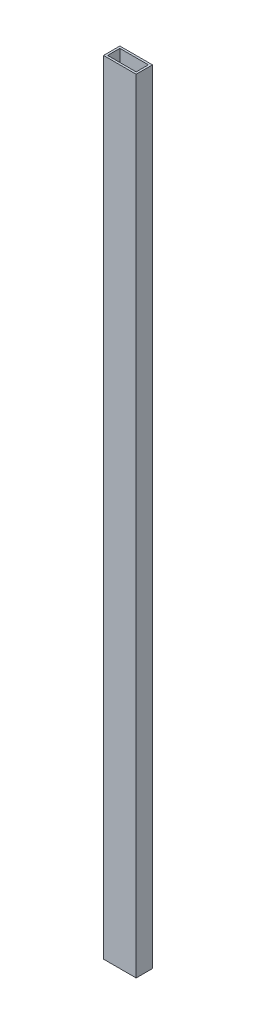
ISO-10303-21;
HEADER;
FILE_DESCRIPTION(('STEP AP214'),'2;1');
FILE_NAME('part.step','',(''),(''),'','','');
FILE_SCHEMA(('AUTOMOTIVE_DESIGN { 1 0 10303 214 1 1 1 1 }'));
ENDSEC;
DATA;
#1=APPLICATION_CONTEXT('core data for automotive mechanical design processes');
#2=APPLICATION_PROTOCOL_DEFINITION('international standard','automotive_design',2000,#1);
#3=PRODUCT_CONTEXT('',#1,'mechanical');
#4=PRODUCT('Part','Part','',(#3));
#5=PRODUCT_RELATED_PRODUCT_CATEGORY('part','',(#4));
#6=PRODUCT_DEFINITION_FORMATION('','',#4);
#7=PRODUCT_DEFINITION_CONTEXT('part definition',#1,'design');
#8=PRODUCT_DEFINITION('design','',#6,#7);
#9=PRODUCT_DEFINITION_SHAPE('','',#8);
#10=(LENGTH_UNIT() NAMED_UNIT(*) SI_UNIT(.MILLI.,.METRE.));
#11=(NAMED_UNIT(*) PLANE_ANGLE_UNIT() SI_UNIT($,.RADIAN.));
#12=(NAMED_UNIT(*) SI_UNIT($,.STERADIAN.) SOLID_ANGLE_UNIT());
#13=UNCERTAINTY_MEASURE_WITH_UNIT(LENGTH_MEASURE(1.E-05),#10,'distance_accuracy_value','');
#14=(GEOMETRIC_REPRESENTATION_CONTEXT(3) GLOBAL_UNCERTAINTY_ASSIGNED_CONTEXT((#13)) GLOBAL_UNIT_ASSIGNED_CONTEXT((#10,
#11,#12)) REPRESENTATION_CONTEXT('',''));
#15=CARTESIAN_POINT('',(0.,0.,0.));
#16=DIRECTION('',(0.,0.,1.));
#17=DIRECTION('',(1.,0.,0.));
#18=AXIS2_PLACEMENT_3D('',#15,#16,#17);
#19=CARTESIAN_POINT('',(0.,1219.2,0.));
#20=DIRECTION('',(0.,-1.,0.));
#21=DIRECTION('',(0.,0.,-1.));
#22=AXIS2_PLACEMENT_3D('',#19,#20,#21);
#23=PLANE('',#22);
#24=DIRECTION('',(0.,0.,-1.));
#25=VECTOR('',#24,1.);
#26=CARTESIAN_POINT('',(25.4,1219.2,12.7));
#27=LINE('',#26,#25);
#28=CARTESIAN_POINT('',(25.4,1219.2,12.7));
#29=VERTEX_POINT('',#28);
#30=CARTESIAN_POINT('',(25.4,1219.2,-12.7));
#31=VERTEX_POINT('',#30);
#32=EDGE_CURVE('E139',#29,#31,#27,.T.);
#33=ORIENTED_EDGE('',*,*,#32,.T.);
#34=DIRECTION('',(-1.,0.,0.));
#35=VECTOR('',#34,1.);
#36=CARTESIAN_POINT('',(-25.4,1219.2,-12.7));
#37=LINE('',#36,#35);
#38=CARTESIAN_POINT('',(-25.4,1219.2,-12.7));
#39=VERTEX_POINT('',#38);
#40=EDGE_CURVE('E142',#31,#39,#37,.T.);
#41=ORIENTED_EDGE('',*,*,#40,.T.);
#42=DIRECTION('',(0.,0.,1.));
#43=VECTOR('',#42,1.);
#44=CARTESIAN_POINT('',(-25.4,1219.2,12.7));
#45=LINE('',#44,#43);
#46=CARTESIAN_POINT('',(-25.4,1219.2,12.7));
#47=VERTEX_POINT('',#46);
#48=EDGE_CURVE('E145',#39,#47,#45,.T.);
#49=ORIENTED_EDGE('',*,*,#48,.T.);
#50=DIRECTION('',(1.,0.,0.));
#51=VECTOR('',#50,1.);
#52=CARTESIAN_POINT('',(-25.4,1219.2,12.7));
#53=LINE('',#52,#51);
#54=EDGE_CURVE('E147',#47,#29,#53,.T.);
#55=ORIENTED_EDGE('',*,*,#54,.T.);
#56=EDGE_LOOP('',(#33,#41,#49,#55));
#57=FACE_BOUND('',#56,.T.);
#58=DIRECTION('',(0.,0.,-1.));
#59=VECTOR('',#58,1.);
#60=CARTESIAN_POINT('',(22.225,1219.2,9.525));
#61=LINE('',#60,#59);
#62=CARTESIAN_POINT('',(22.225,1219.2,9.525));
#63=VERTEX_POINT('',#62);
#64=CARTESIAN_POINT('',(22.225,1219.2,-9.525));
#65=VERTEX_POINT('',#64);
#66=EDGE_CURVE('E103',#63,#65,#61,.T.);
#67=ORIENTED_EDGE('',*,*,#66,.F.);
#68=DIRECTION('',(1.,0.,0.));
#69=VECTOR('',#68,1.);
#70=CARTESIAN_POINT('',(-22.225,1219.2,9.525));
#71=LINE('',#70,#69);
#72=CARTESIAN_POINT('',(-22.225,1219.2,9.525));
#73=VERTEX_POINT('',#72);
#74=EDGE_CURVE('E125',#73,#63,#71,.T.);
#75=ORIENTED_EDGE('',*,*,#74,.F.);
#76=DIRECTION('',(0.,0.,1.));
#77=VECTOR('',#76,1.);
#78=CARTESIAN_POINT('',(-22.225,1219.2,9.525));
#79=LINE('',#78,#77);
#80=CARTESIAN_POINT('',(-22.225,1219.2,-9.525));
#81=VERTEX_POINT('',#80);
#82=EDGE_CURVE('E123',#81,#73,#79,.T.);
#83=ORIENTED_EDGE('',*,*,#82,.F.);
#84=DIRECTION('',(-1.,0.,0.));
#85=VECTOR('',#84,1.);
#86=CARTESIAN_POINT('',(-22.225,1219.2,-9.525));
#87=LINE('',#86,#85);
#88=EDGE_CURVE('E111',#65,#81,#87,.T.);
#89=ORIENTED_EDGE('',*,*,#88,.F.);
#90=EDGE_LOOP('',(#67,#75,#83,#89));
#91=FACE_BOUND('',#90,.T.);
#92=ADVANCED_FACE('F38',(#57,#91),#23,.F.);
#93=CARTESIAN_POINT('',(0.,0.,0.));
#94=DIRECTION('',(0.,-1.,0.));
#95=DIRECTION('',(0.,0.,-1.));
#96=AXIS2_PLACEMENT_3D('',#93,#94,#95);
#97=PLANE('',#96);
#98=DIRECTION('',(0.,0.,-1.));
#99=VECTOR('',#98,1.);
#100=CARTESIAN_POINT('',(25.4,0.,12.7));
#101=LINE('',#100,#99);
#102=CARTESIAN_POINT('',(25.4,0.,12.7));
#103=VERTEX_POINT('',#102);
#104=CARTESIAN_POINT('',(25.4,0.,-12.7));
#105=VERTEX_POINT('',#104);
#106=EDGE_CURVE('E119',#103,#105,#101,.T.);
#107=ORIENTED_EDGE('',*,*,#106,.F.);
#108=DIRECTION('',(1.,0.,0.));
#109=VECTOR('',#108,1.);
#110=CARTESIAN_POINT('',(-25.4,0.,12.7));
#111=LINE('',#110,#109);
#112=CARTESIAN_POINT('',(-25.4,0.,12.7));
#113=VERTEX_POINT('',#112);
#114=EDGE_CURVE('E143',#113,#103,#111,.T.);
#115=ORIENTED_EDGE('',*,*,#114,.F.);
#116=DIRECTION('',(0.,0.,1.));
#117=VECTOR('',#116,1.);
#118=CARTESIAN_POINT('',(-25.4,0.,12.7));
#119=LINE('',#118,#117);
#120=CARTESIAN_POINT('',(-25.4,0.,-12.7));
#121=VERTEX_POINT('',#120);
#122=EDGE_CURVE('E154',#121,#113,#119,.T.);
#123=ORIENTED_EDGE('',*,*,#122,.F.);
#124=DIRECTION('',(-1.,0.,0.));
#125=VECTOR('',#124,1.);
#126=CARTESIAN_POINT('',(-25.4,0.,-12.7));
#127=LINE('',#126,#125);
#128=EDGE_CURVE('E152',#105,#121,#127,.T.);
#129=ORIENTED_EDGE('',*,*,#128,.F.);
#130=EDGE_LOOP('',(#107,#115,#123,#129));
#131=FACE_BOUND('',#130,.T.);
#132=DIRECTION('',(1.,0.,0.));
#133=VECTOR('',#132,1.);
#134=CARTESIAN_POINT('',(-22.225,0.,9.525));
#135=LINE('',#134,#133);
#136=CARTESIAN_POINT('',(-22.225,0.,9.525));
#137=VERTEX_POINT('',#136);
#138=CARTESIAN_POINT('',(22.225,0.,9.525));
#139=VERTEX_POINT('',#138);
#140=EDGE_CURVE('E112',#137,#139,#135,.T.);
#141=ORIENTED_EDGE('',*,*,#140,.T.);
#142=DIRECTION('',(0.,0.,-1.));
#143=VECTOR('',#142,1.);
#144=CARTESIAN_POINT('',(22.225,0.,9.525));
#145=LINE('',#144,#143);
#146=CARTESIAN_POINT('',(22.225,0.,-9.525));
#147=VERTEX_POINT('',#146);
#148=EDGE_CURVE('E61',#139,#147,#145,.T.);
#149=ORIENTED_EDGE('',*,*,#148,.T.);
#150=DIRECTION('',(-1.,0.,0.));
#151=VECTOR('',#150,1.);
#152=CARTESIAN_POINT('',(-22.225,0.,-9.525));
#153=LINE('',#152,#151);
#154=CARTESIAN_POINT('',(-22.225,0.,-9.525));
#155=VERTEX_POINT('',#154);
#156=EDGE_CURVE('E118',#147,#155,#153,.T.);
#157=ORIENTED_EDGE('',*,*,#156,.T.);
#158=DIRECTION('',(0.,0.,1.));
#159=VECTOR('',#158,1.);
#160=CARTESIAN_POINT('',(-22.225,0.,9.525));
#161=LINE('',#160,#159);
#162=EDGE_CURVE('E131',#155,#137,#161,.T.);
#163=ORIENTED_EDGE('',*,*,#162,.T.);
#164=EDGE_LOOP('',(#141,#149,#157,#163));
#165=FACE_BOUND('',#164,.T.);
#166=ADVANCED_FACE('F172',(#131,#165),#97,.T.);
#167=CARTESIAN_POINT('',(25.4,1219.2,12.7));
#168=DIRECTION('',(-1.,0.,0.));
#169=DIRECTION('',(0.,0.,1.));
#170=AXIS2_PLACEMENT_3D('',#167,#168,#169);
#171=PLANE('',#170);
#172=ORIENTED_EDGE('',*,*,#106,.T.);
#173=DIRECTION('',(0.,-1.,0.));
#174=VECTOR('',#173,1.);
#175=CARTESIAN_POINT('',(25.4,1219.2,-12.7));
#176=LINE('',#175,#174);
#177=EDGE_CURVE('E11',#31,#105,#176,.T.);
#178=ORIENTED_EDGE('',*,*,#177,.F.);
#179=ORIENTED_EDGE('',*,*,#32,.F.);
#180=DIRECTION('',(0.,-1.,0.));
#181=VECTOR('',#180,1.);
#182=CARTESIAN_POINT('',(25.4,1219.2,12.7));
#183=LINE('',#182,#181);
#184=EDGE_CURVE('E149',#29,#103,#183,.T.);
#185=ORIENTED_EDGE('',*,*,#184,.T.);
#186=EDGE_LOOP('',(#172,#178,#179,#185));
#187=FACE_BOUND('',#186,.T.);
#188=ADVANCED_FACE('F40',(#187),#171,.F.);
#189=CARTESIAN_POINT('',(-25.4,1219.2,-12.7));
#190=DIRECTION('',(0.,0.,1.));
#191=DIRECTION('',(1.,0.,0.));
#192=AXIS2_PLACEMENT_3D('',#189,#190,#191);
#193=PLANE('',#192);
#194=ORIENTED_EDGE('',*,*,#128,.T.);
#195=DIRECTION('',(0.,-1.,0.));
#196=VECTOR('',#195,1.);
#197=CARTESIAN_POINT('',(-25.4,1219.2,-12.7));
#198=LINE('',#197,#196);
#199=EDGE_CURVE('E46',#39,#121,#198,.T.);
#200=ORIENTED_EDGE('',*,*,#199,.F.);
#201=ORIENTED_EDGE('',*,*,#40,.F.);
#202=ORIENTED_EDGE('',*,*,#177,.T.);
#203=EDGE_LOOP('',(#194,#200,#201,#202));
#204=FACE_BOUND('',#203,.T.);
#205=ADVANCED_FACE('F182',(#204),#193,.F.);
#206=CARTESIAN_POINT('',(-25.4,1219.2,12.7));
#207=DIRECTION('',(1.,0.,0.));
#208=DIRECTION('',(0.,0.,-1.));
#209=AXIS2_PLACEMENT_3D('',#206,#207,#208);
#210=PLANE('',#209);
#211=ORIENTED_EDGE('',*,*,#122,.T.);
#212=DIRECTION('',(0.,-1.,0.));
#213=VECTOR('',#212,1.);
#214=CARTESIAN_POINT('',(-25.4,1219.2,12.7));
#215=LINE('',#214,#213);
#216=EDGE_CURVE('E159',#47,#113,#215,.T.);
#217=ORIENTED_EDGE('',*,*,#216,.F.);
#218=ORIENTED_EDGE('',*,*,#48,.F.);
#219=ORIENTED_EDGE('',*,*,#199,.T.);
#220=EDGE_LOOP('',(#211,#217,#218,#219));
#221=FACE_BOUND('',#220,.T.);
#222=ADVANCED_FACE('F166',(#221),#210,.F.);
#223=CARTESIAN_POINT('',(-25.4,1219.2,12.7));
#224=DIRECTION('',(0.,0.,-1.));
#225=DIRECTION('',(-1.,0.,0.));
#226=AXIS2_PLACEMENT_3D('',#223,#224,#225);
#227=PLANE('',#226);
#228=ORIENTED_EDGE('',*,*,#114,.T.);
#229=ORIENTED_EDGE('',*,*,#184,.F.);
#230=ORIENTED_EDGE('',*,*,#54,.F.);
#231=ORIENTED_EDGE('',*,*,#216,.T.);
#232=EDGE_LOOP('',(#228,#229,#230,#231));
#233=FACE_BOUND('',#232,.T.);
#234=ADVANCED_FACE('F176',(#233),#227,.F.);
#235=CARTESIAN_POINT('',(22.225,1219.2,9.525));
#236=DIRECTION('',(-1.,0.,0.));
#237=DIRECTION('',(0.,0.,1.));
#238=AXIS2_PLACEMENT_3D('',#235,#236,#237);
#239=PLANE('',#238);
#240=ORIENTED_EDGE('',*,*,#148,.F.);
#241=DIRECTION('',(0.,-1.,0.));
#242=VECTOR('',#241,1.);
#243=CARTESIAN_POINT('',(22.225,1219.2,9.525));
#244=LINE('',#243,#242);
#245=EDGE_CURVE('E107',#63,#139,#244,.T.);
#246=ORIENTED_EDGE('',*,*,#245,.F.);
#247=ORIENTED_EDGE('',*,*,#66,.T.);
#248=DIRECTION('',(0.,-1.,0.));
#249=VECTOR('',#248,1.);
#250=CARTESIAN_POINT('',(22.225,1219.2,-9.525));
#251=LINE('',#250,#249);
#252=EDGE_CURVE('E106',#65,#147,#251,.T.);
#253=ORIENTED_EDGE('',*,*,#252,.T.);
#254=EDGE_LOOP('',(#240,#246,#247,#253));
#255=FACE_BOUND('',#254,.T.);
#256=ADVANCED_FACE('F105',(#255),#239,.T.);
#257=CARTESIAN_POINT('',(-22.225,1219.2,-9.525));
#258=DIRECTION('',(0.,0.,1.));
#259=DIRECTION('',(1.,0.,0.));
#260=AXIS2_PLACEMENT_3D('',#257,#258,#259);
#261=PLANE('',#260);
#262=ORIENTED_EDGE('',*,*,#156,.F.);
#263=ORIENTED_EDGE('',*,*,#252,.F.);
#264=ORIENTED_EDGE('',*,*,#88,.T.);
#265=DIRECTION('',(0.,-1.,0.));
#266=VECTOR('',#265,1.);
#267=CARTESIAN_POINT('',(-22.225,1219.2,-9.525));
#268=LINE('',#267,#266);
#269=EDGE_CURVE('E120',#81,#155,#268,.T.);
#270=ORIENTED_EDGE('',*,*,#269,.T.);
#271=EDGE_LOOP('',(#262,#263,#264,#270));
#272=FACE_BOUND('',#271,.T.);
#273=ADVANCED_FACE('F115',(#272),#261,.T.);
#274=CARTESIAN_POINT('',(-22.225,1219.2,9.525));
#275=DIRECTION('',(1.,0.,0.));
#276=DIRECTION('',(0.,0.,-1.));
#277=AXIS2_PLACEMENT_3D('',#274,#275,#276);
#278=PLANE('',#277);
#279=ORIENTED_EDGE('',*,*,#162,.F.);
#280=ORIENTED_EDGE('',*,*,#269,.F.);
#281=ORIENTED_EDGE('',*,*,#82,.T.);
#282=DIRECTION('',(0.,-1.,0.));
#283=VECTOR('',#282,1.);
#284=CARTESIAN_POINT('',(-22.225,1219.2,9.525));
#285=LINE('',#284,#283);
#286=EDGE_CURVE('E53',#73,#137,#285,.T.);
#287=ORIENTED_EDGE('',*,*,#286,.T.);
#288=EDGE_LOOP('',(#279,#280,#281,#287));
#289=FACE_BOUND('',#288,.T.);
#290=ADVANCED_FACE('F205',(#289),#278,.T.);
#291=CARTESIAN_POINT('',(-22.225,1219.2,9.525));
#292=DIRECTION('',(0.,0.,-1.));
#293=DIRECTION('',(-1.,0.,0.));
#294=AXIS2_PLACEMENT_3D('',#291,#292,#293);
#295=PLANE('',#294);
#296=ORIENTED_EDGE('',*,*,#140,.F.);
#297=ORIENTED_EDGE('',*,*,#286,.F.);
#298=ORIENTED_EDGE('',*,*,#74,.T.);
#299=ORIENTED_EDGE('',*,*,#245,.T.);
#300=EDGE_LOOP('',(#296,#297,#298,#299));
#301=FACE_BOUND('',#300,.T.);
#302=ADVANCED_FACE('F209',(#301),#295,.T.);
#303=CLOSED_SHELL('',(#92,#166,#188,#205,#222,#234,#256,#273,#290,#302));
#304=MANIFOLD_SOLID_BREP('B2',#303);
#305=ADVANCED_BREP_SHAPE_REPRESENTATION('',(#18,#304),#14);
#306=SHAPE_DEFINITION_REPRESENTATION(#9,#305);
ENDSEC;
END-ISO-10303-21;
